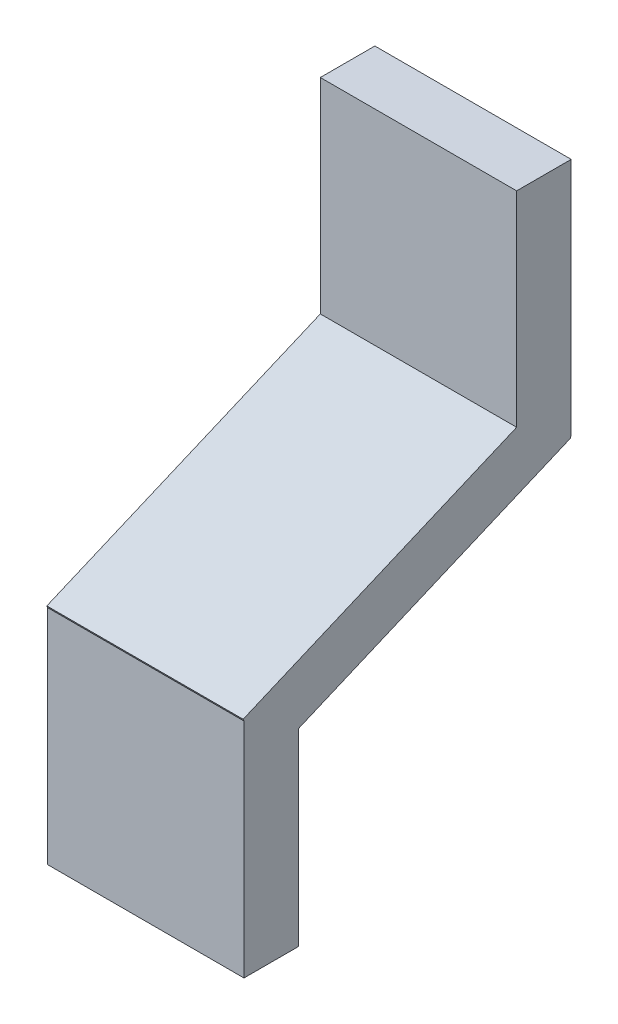
ISO-10303-21;
HEADER;
FILE_DESCRIPTION(('STEP AP214'),'2;1');
FILE_NAME('part.step','',(''),(''),'','','');
FILE_SCHEMA(('AUTOMOTIVE_DESIGN { 1 0 10303 214 1 1 1 1 }'));
ENDSEC;
DATA;
#1=APPLICATION_CONTEXT('core data for automotive mechanical design processes');
#2=APPLICATION_PROTOCOL_DEFINITION('international standard','automotive_design',2000,#1);
#3=PRODUCT_CONTEXT('',#1,'mechanical');
#4=PRODUCT('Part','Part','',(#3));
#5=PRODUCT_RELATED_PRODUCT_CATEGORY('part','',(#4));
#6=PRODUCT_DEFINITION_FORMATION('','',#4);
#7=PRODUCT_DEFINITION_CONTEXT('part definition',#1,'design');
#8=PRODUCT_DEFINITION('design','',#6,#7);
#9=PRODUCT_DEFINITION_SHAPE('','',#8);
#10=(LENGTH_UNIT() NAMED_UNIT(*) SI_UNIT(.MILLI.,.METRE.));
#11=(NAMED_UNIT(*) PLANE_ANGLE_UNIT() SI_UNIT($,.RADIAN.));
#12=(NAMED_UNIT(*) SI_UNIT($,.STERADIAN.) SOLID_ANGLE_UNIT());
#13=UNCERTAINTY_MEASURE_WITH_UNIT(LENGTH_MEASURE(1.E-05),#10,'distance_accuracy_value','');
#14=(GEOMETRIC_REPRESENTATION_CONTEXT(3) GLOBAL_UNCERTAINTY_ASSIGNED_CONTEXT((#13)) GLOBAL_UNIT_ASSIGNED_CONTEXT((#10,
#11,#12)) REPRESENTATION_CONTEXT('',''));
#15=CARTESIAN_POINT('',(0.,0.,0.));
#16=DIRECTION('',(0.,0.,1.));
#17=DIRECTION('',(1.,0.,0.));
#18=AXIS2_PLACEMENT_3D('',#15,#16,#17);
#19=CARTESIAN_POINT('',(1.82,11.,0.5));
#20=DIRECTION('',(0.,0.,1.));
#21=DIRECTION('',(1.,0.,0.));
#22=AXIS2_PLACEMENT_3D('',#19,#20,#21);
#23=PLANE('',#22);
#24=DIRECTION('',(1.,0.,0.));
#25=VECTOR('',#24,1.);
#26=CARTESIAN_POINT('',(1.82,11.3461054439247,0.500000000000314));
#27=LINE('',#26,#25);
#28=CARTESIAN_POINT('',(2.180000014305,11.3461054439242,0.500000000000105));
#29=VERTEX_POINT('',#28);
#30=CARTESIAN_POINT('',(1.82,11.3461054439243,0.500000000000105));
#31=VERTEX_POINT('',#30);
#32=EDGE_CURVE('E148',#29,#31,#27,.F.);
#33=ORIENTED_EDGE('',*,*,#32,.F.);
#34=DIRECTION('',(0.,1.,0.));
#35=VECTOR('',#34,1.);
#36=CARTESIAN_POINT('',(2.180000014305,11.65,0.5));
#37=LINE('',#36,#35);
#38=CARTESIAN_POINT('',(2.180000014305,11.,0.5));
#39=VERTEX_POINT('',#38);
#40=EDGE_CURVE('E154',#39,#29,#37,.T.);
#41=ORIENTED_EDGE('',*,*,#40,.F.);
#42=DIRECTION('',(1.,0.,0.));
#43=VECTOR('',#42,1.);
#44=CARTESIAN_POINT('',(1.82,11.,0.5));
#45=LINE('',#44,#43);
#46=CARTESIAN_POINT('',(1.82,11.,0.5));
#47=VERTEX_POINT('',#46);
#48=EDGE_CURVE('E135',#39,#47,#45,.F.);
#49=ORIENTED_EDGE('',*,*,#48,.T.);
#50=DIRECTION('',(0.,1.,0.));
#51=VECTOR('',#50,1.);
#52=CARTESIAN_POINT('',(1.82,11.65,0.5));
#53=LINE('',#52,#51);
#54=EDGE_CURVE('E182',#47,#31,#53,.T.);
#55=ORIENTED_EDGE('',*,*,#54,.T.);
#56=EDGE_LOOP('',(#33,#41,#49,#55));
#57=FACE_BOUND('',#56,.T.);
#58=ADVANCED_FACE('F17',(#57),#23,.F.);
#59=CARTESIAN_POINT('',(1.82,11.557949520001,0.0009268707435865));
#60=DIRECTION('',(0.,-0.920504786278108,-0.390731286742046));
#61=DIRECTION('',(0.,0.390731286742046,-0.920504786278108));
#62=AXIS2_PLACEMENT_3D('',#59,#60,#61);
#63=PLANE('',#62);
#64=DIRECTION('',(0.,0.39073128674346,-0.920504786277508));
#65=VECTOR('',#64,1.);
#66=CARTESIAN_POINT('',(2.180000014305,11.346105443924,0.5));
#67=LINE('',#66,#65);
#68=CARTESIAN_POINT('',(2.180000014305,11.557949520001,0.000926870743687937));
#69=VERTEX_POINT('',#68);
#70=EDGE_CURVE('E151',#29,#69,#67,.T.);
#71=ORIENTED_EDGE('',*,*,#70,.F.);
#72=ORIENTED_EDGE('',*,*,#32,.T.);
#73=DIRECTION('',(0.,0.39073128674346,-0.920504786277508));
#74=VECTOR('',#73,1.);
#75=CARTESIAN_POINT('',(1.82,11.346105443924,0.5));
#76=LINE('',#75,#74);
#77=CARTESIAN_POINT('',(1.82,11.557949520001,0.000926870743697301));
#78=VERTEX_POINT('',#77);
#79=EDGE_CURVE('E178',#31,#78,#76,.T.);
#80=ORIENTED_EDGE('',*,*,#79,.T.);
#81=DIRECTION('',(1.,0.,0.));
#82=VECTOR('',#81,1.);
#83=CARTESIAN_POINT('',(1.82,11.557949520001,0.00092687074374427));
#84=LINE('',#83,#82);
#85=EDGE_CURVE('E145',#78,#69,#84,.T.);
#86=ORIENTED_EDGE('',*,*,#85,.T.);
#87=EDGE_LOOP('',(#71,#72,#80,#86));
#88=FACE_BOUND('',#87,.T.);
#89=ADVANCED_FACE('F242',(#88),#63,.T.);
#90=CARTESIAN_POINT('',(1.82,11.65,0.04));
#91=DIRECTION('',(0.,-0.390731286742046,0.920504786278108));
#92=DIRECTION('',(0.,-0.920504786278108,-0.390731286742046));
#93=AXIS2_PLACEMENT_3D('',#90,#91,#92);
#94=PLANE('',#93);
#95=DIRECTION('',(0.,0.920504786259214,0.390731286786557));
#96=VECTOR('',#95,1.);
#97=CARTESIAN_POINT('',(1.82,11.557949520001,0.000926870743659899));
#98=LINE('',#97,#96);
#99=CARTESIAN_POINT('',(1.82,11.56,0.001797248280528));
#100=VERTEX_POINT('',#99);
#101=EDGE_CURVE('E123',#78,#100,#98,.T.);
#102=ORIENTED_EDGE('',*,*,#101,.T.);
#103=DIRECTION('',(1.,0.,0.));
#104=VECTOR('',#103,1.);
#105=CARTESIAN_POINT('',(1.82,11.56,0.001797248280528));
#106=LINE('',#105,#104);
#107=CARTESIAN_POINT('',(2.180000014305,11.56,0.001797248280528));
#108=VERTEX_POINT('',#107);
#109=EDGE_CURVE('E97',#100,#108,#106,.T.);
#110=ORIENTED_EDGE('',*,*,#109,.T.);
#111=DIRECTION('',(0.,0.920504786259214,0.390731286786557));
#112=VECTOR('',#111,1.);
#113=CARTESIAN_POINT('',(2.180000014305,11.557949520001,0.000926870743659899));
#114=LINE('',#113,#112);
#115=EDGE_CURVE('E153',#69,#108,#114,.T.);
#116=ORIENTED_EDGE('',*,*,#115,.F.);
#117=ORIENTED_EDGE('',*,*,#85,.F.);
#118=EDGE_LOOP('',(#102,#110,#116,#117));
#119=FACE_BOUND('',#118,.T.);
#120=ADVANCED_FACE('F243',(#119),#94,.F.);
#121=CARTESIAN_POINT('',(1.82,11.56,0.));
#122=DIRECTION('',(0.,1.,0.));
#123=DIRECTION('',(0.,0.,1.));
#124=AXIS2_PLACEMENT_3D('',#121,#122,#123);
#125=PLANE('',#124);
#126=ORIENTED_EDGE('',*,*,#109,.F.);
#127=DIRECTION('',(0.,0.,1.));
#128=VECTOR('',#127,1.);
#129=CARTESIAN_POINT('',(1.82,11.56,0.));
#130=LINE('',#129,#128);
#131=CARTESIAN_POINT('',(1.82,11.56,0.));
#132=VERTEX_POINT('',#131);
#133=EDGE_CURVE('E20',#100,#132,#130,.F.);
#134=ORIENTED_EDGE('',*,*,#133,.T.);
#135=DIRECTION('',(1.,0.,0.));
#136=VECTOR('',#135,1.);
#137=CARTESIAN_POINT('',(1.82,11.56,0.));
#138=LINE('',#137,#136);
#139=CARTESIAN_POINT('',(2.180000014305,11.56,0.));
#140=VERTEX_POINT('',#139);
#141=EDGE_CURVE('E104',#132,#140,#138,.T.);
#142=ORIENTED_EDGE('',*,*,#141,.T.);
#143=DIRECTION('',(0.,0.,-1.));
#144=VECTOR('',#143,1.);
#145=CARTESIAN_POINT('',(2.180000014305,11.56,0.04));
#146=LINE('',#145,#144);
#147=EDGE_CURVE('E194',#108,#140,#146,.T.);
#148=ORIENTED_EDGE('',*,*,#147,.F.);
#149=EDGE_LOOP('',(#126,#134,#142,#148));
#150=FACE_BOUND('',#149,.T.);
#151=ADVANCED_FACE('F122',(#150),#125,.F.);
#152=CARTESIAN_POINT('',(1.82,11.56,0.));
#153=DIRECTION('',(0.,0.,1.));
#154=DIRECTION('',(1.,0.,0.));
#155=AXIS2_PLACEMENT_3D('',#152,#153,#154);
#156=PLANE('',#155);
#157=ORIENTED_EDGE('',*,*,#141,.F.);
#158=DIRECTION('',(0.,1.,0.));
#159=VECTOR('',#158,1.);
#160=CARTESIAN_POINT('',(1.82,11.65,0.));
#161=LINE('',#160,#159);
#162=CARTESIAN_POINT('',(1.82,11.999999997616,0.));
#163=VERTEX_POINT('',#162);
#164=EDGE_CURVE('E108',#132,#163,#161,.T.);
#165=ORIENTED_EDGE('',*,*,#164,.T.);
#166=DIRECTION('',(1.,0.,0.));
#167=VECTOR('',#166,1.);
#168=CARTESIAN_POINT('',(1.82,11.999999997616,0.));
#169=LINE('',#168,#167);
#170=CARTESIAN_POINT('',(2.180000014305,11.999999997616,0.));
#171=VERTEX_POINT('',#170);
#172=EDGE_CURVE('E110',#171,#163,#169,.F.);
#173=ORIENTED_EDGE('',*,*,#172,.F.);
#174=DIRECTION('',(0.,1.,0.));
#175=VECTOR('',#174,1.);
#176=CARTESIAN_POINT('',(2.180000014305,11.65,0.));
#177=LINE('',#176,#175);
#178=EDGE_CURVE('E109',#140,#171,#177,.T.);
#179=ORIENTED_EDGE('',*,*,#178,.F.);
#180=EDGE_LOOP('',(#157,#165,#173,#179));
#181=FACE_BOUND('',#180,.T.);
#182=ADVANCED_FACE('F106',(#181),#156,.F.);
#183=CARTESIAN_POINT('',(1.82,11.999999997616,0.));
#184=DIRECTION('',(0.,1.,0.));
#185=DIRECTION('',(0.,0.,1.));
#186=AXIS2_PLACEMENT_3D('',#183,#184,#185);
#187=PLANE('',#186);
#188=ORIENTED_EDGE('',*,*,#172,.T.);
#189=DIRECTION('',(0.,0.,-1.));
#190=VECTOR('',#189,1.);
#191=CARTESIAN_POINT('',(1.82,11.999999997616,0.04));
#192=LINE('',#191,#190);
#193=CARTESIAN_POINT('',(1.82,11.999999997616,0.10000000149));
#194=VERTEX_POINT('',#193);
#195=EDGE_CURVE('E120',#163,#194,#192,.F.);
#196=ORIENTED_EDGE('',*,*,#195,.T.);
#197=DIRECTION('',(1.,0.,0.));
#198=VECTOR('',#197,1.);
#199=CARTESIAN_POINT('',(1.82,11.999999997616,0.10000000149));
#200=LINE('',#199,#198);
#201=CARTESIAN_POINT('',(2.180000014305,11.999999997616,0.10000000149));
#202=VERTEX_POINT('',#201);
#203=EDGE_CURVE('E181',#202,#194,#200,.F.);
#204=ORIENTED_EDGE('',*,*,#203,.F.);
#205=DIRECTION('',(0.,0.,-1.));
#206=VECTOR('',#205,1.);
#207=CARTESIAN_POINT('',(2.180000014305,11.999999997616,0.04));
#208=LINE('',#207,#206);
#209=EDGE_CURVE('E140',#171,#202,#208,.F.);
#210=ORIENTED_EDGE('',*,*,#209,.F.);
#211=EDGE_LOOP('',(#188,#196,#204,#210));
#212=FACE_BOUND('',#211,.T.);
#213=ADVANCED_FACE('F271',(#212),#187,.T.);
#214=CARTESIAN_POINT('',(1.82,11.,0.60000000149));
#215=DIRECTION('',(0.,0.,1.));
#216=DIRECTION('',(1.,0.,0.));
#217=AXIS2_PLACEMENT_3D('',#214,#215,#216);
#218=PLANE('',#217);
#219=DIRECTION('',(0.,1.,0.));
#220=VECTOR('',#219,1.);
#221=CARTESIAN_POINT('',(2.180000014305,11.65,0.60000000149));
#222=LINE('',#221,#220);
#223=CARTESIAN_POINT('',(2.180000014305,11.408101447657,0.600000001490072));
#224=VERTEX_POINT('',#223);
#225=CARTESIAN_POINT('',(2.180000014305,11.,0.60000000149));
#226=VERTEX_POINT('',#225);
#227=EDGE_CURVE('E168',#224,#226,#222,.F.);
#228=ORIENTED_EDGE('',*,*,#227,.F.);
#229=DIRECTION('',(1.,0.,0.));
#230=VECTOR('',#229,1.);
#231=CARTESIAN_POINT('',(1.82,11.4081014476569,0.600000001490144));
#232=LINE('',#231,#230);
#233=CARTESIAN_POINT('',(1.82,11.408101447657,0.600000001490072));
#234=VERTEX_POINT('',#233);
#235=EDGE_CURVE('E124',#234,#224,#232,.T.);
#236=ORIENTED_EDGE('',*,*,#235,.F.);
#237=DIRECTION('',(0.,1.,0.));
#238=VECTOR('',#237,1.);
#239=CARTESIAN_POINT('',(1.82,11.65,0.60000000149));
#240=LINE('',#239,#238);
#241=CARTESIAN_POINT('',(1.82,11.,0.60000000149));
#242=VERTEX_POINT('',#241);
#243=EDGE_CURVE('E192',#234,#242,#240,.F.);
#244=ORIENTED_EDGE('',*,*,#243,.T.);
#245=DIRECTION('',(1.,0.,0.));
#246=VECTOR('',#245,1.);
#247=CARTESIAN_POINT('',(1.82,11.,0.60000000149));
#248=LINE('',#247,#246);
#249=EDGE_CURVE('E127',#242,#226,#248,.T.);
#250=ORIENTED_EDGE('',*,*,#249,.T.);
#251=EDGE_LOOP('',(#228,#236,#244,#250));
#252=FACE_BOUND('',#251,.T.);
#253=ADVANCED_FACE('F232',(#252),#218,.T.);
#254=CARTESIAN_POINT('',(1.82,11.,0.5));
#255=DIRECTION('',(0.,1.,0.));
#256=DIRECTION('',(0.,0.,1.));
#257=AXIS2_PLACEMENT_3D('',#254,#255,#256);
#258=PLANE('',#257);
#259=DIRECTION('',(0.,0.,-1.));
#260=VECTOR('',#259,1.);
#261=CARTESIAN_POINT('',(1.82,11.,0.04));
#262=LINE('',#261,#260);
#263=EDGE_CURVE('E187',#242,#47,#262,.T.);
#264=ORIENTED_EDGE('',*,*,#263,.T.);
#265=ORIENTED_EDGE('',*,*,#48,.F.);
#266=DIRECTION('',(0.,0.,-1.));
#267=VECTOR('',#266,1.);
#268=CARTESIAN_POINT('',(2.180000014305,11.,0.04));
#269=LINE('',#268,#267);
#270=EDGE_CURVE('E164',#226,#39,#269,.T.);
#271=ORIENTED_EDGE('',*,*,#270,.F.);
#272=ORIENTED_EDGE('',*,*,#249,.F.);
#273=EDGE_LOOP('',(#264,#265,#271,#272));
#274=FACE_BOUND('',#273,.T.);
#275=ADVANCED_FACE('F235',(#274),#258,.F.);
#276=CARTESIAN_POINT('',(1.82,11.411653909498,0.601507932798));
#277=DIRECTION('',(0.,-0.390731286742046,0.920504786278108));
#278=DIRECTION('',(0.,-0.920504786278108,-0.390731286742046));
#279=AXIS2_PLACEMENT_3D('',#276,#277,#278);
#280=PLANE('',#279);
#281=ORIENTED_EDGE('',*,*,#235,.T.);
#282=DIRECTION('',(0.,-0.920504786262243,-0.390731286779422));
#283=VECTOR('',#282,1.);
#284=CARTESIAN_POINT('',(2.180000014305,11.411653909498,0.601507932798));
#285=LINE('',#284,#283);
#286=CARTESIAN_POINT('',(2.180000014305,11.4116539094979,0.601507932797974));
#287=VERTEX_POINT('',#286);
#288=EDGE_CURVE('E227',#287,#224,#285,.T.);
#289=ORIENTED_EDGE('',*,*,#288,.F.);
#290=DIRECTION('',(1.,0.,0.));
#291=VECTOR('',#290,1.);
#292=CARTESIAN_POINT('',(1.82,11.4116539094978,0.601507932797897));
#293=LINE('',#292,#291);
#294=CARTESIAN_POINT('',(1.82,11.4116539094979,0.601507932797974));
#295=VERTEX_POINT('',#294);
#296=EDGE_CURVE('E167',#287,#295,#293,.F.);
#297=ORIENTED_EDGE('',*,*,#296,.T.);
#298=DIRECTION('',(0.,-0.920504786262243,-0.390731286779422));
#299=VECTOR('',#298,1.);
#300=CARTESIAN_POINT('',(1.82,11.411653909498,0.601507932798));
#301=LINE('',#300,#299);
#302=EDGE_CURVE('E175',#295,#234,#301,.T.);
#303=ORIENTED_EDGE('',*,*,#302,.T.);
#304=EDGE_LOOP('',(#281,#289,#297,#303));
#305=FACE_BOUND('',#304,.T.);
#306=ADVANCED_FACE('F210',(#305),#280,.T.);
#307=CARTESIAN_POINT('',(1.82,11.65,0.04));
#308=DIRECTION('',(1.,0.,0.));
#309=DIRECTION('',(0.,0.,-1.));
#310=AXIS2_PLACEMENT_3D('',#307,#308,#309);
#311=PLANE('',#310);
#312=ORIENTED_EDGE('',*,*,#54,.F.);
#313=ORIENTED_EDGE('',*,*,#263,.F.);
#314=ORIENTED_EDGE('',*,*,#243,.F.);
#315=ORIENTED_EDGE('',*,*,#302,.F.);
#316=DIRECTION('',(0.,0.390731286742046,-0.920504786278108));
#317=VECTOR('',#316,1.);
#318=CARTESIAN_POINT('',(1.82,11.65,0.04));
#319=LINE('',#318,#317);
#320=CARTESIAN_POINT('',(1.82,11.624531498221,0.100000001490019));
#321=VERTEX_POINT('',#320);
#322=EDGE_CURVE('E216',#295,#321,#319,.T.);
#323=ORIENTED_EDGE('',*,*,#322,.T.);
#324=DIRECTION('',(0.,1.,0.));
#325=VECTOR('',#324,1.);
#326=CARTESIAN_POINT('',(1.82,11.56,0.10000000149));
#327=LINE('',#326,#325);
#328=EDGE_CURVE('E161',#194,#321,#327,.F.);
#329=ORIENTED_EDGE('',*,*,#328,.F.);
#330=ORIENTED_EDGE('',*,*,#195,.F.);
#331=ORIENTED_EDGE('',*,*,#164,.F.);
#332=ORIENTED_EDGE('',*,*,#133,.F.);
#333=ORIENTED_EDGE('',*,*,#101,.F.);
#334=ORIENTED_EDGE('',*,*,#79,.F.);
#335=EDGE_LOOP('',(#312,#313,#314,#315,#323,#329,#330,#331,#332,#333,#334));
#336=FACE_BOUND('',#335,.T.);
#337=ADVANCED_FACE('F115',(#336),#311,.F.);
#338=CARTESIAN_POINT('',(1.82,11.56,0.10000000149));
#339=DIRECTION('',(0.,0.,1.));
#340=DIRECTION('',(1.,0.,0.));
#341=AXIS2_PLACEMENT_3D('',#338,#339,#340);
#342=PLANE('',#341);
#343=ORIENTED_EDGE('',*,*,#328,.T.);
#344=DIRECTION('',(1.,0.,0.));
#345=VECTOR('',#344,1.);
#346=CARTESIAN_POINT('',(1.82,11.6245314982212,0.100000001490075));
#347=LINE('',#346,#345);
#348=CARTESIAN_POINT('',(2.180000014305,11.624531498221,0.100000001490019));
#349=VERTEX_POINT('',#348);
#350=EDGE_CURVE('E26',#321,#349,#347,.T.);
#351=ORIENTED_EDGE('',*,*,#350,.T.);
#352=DIRECTION('',(0.,1.,0.));
#353=VECTOR('',#352,1.);
#354=CARTESIAN_POINT('',(2.180000014305,11.65,0.10000000149));
#355=LINE('',#354,#353);
#356=EDGE_CURVE('E34',#202,#349,#355,.F.);
#357=ORIENTED_EDGE('',*,*,#356,.F.);
#358=ORIENTED_EDGE('',*,*,#203,.T.);
#359=EDGE_LOOP('',(#343,#351,#357,#358));
#360=FACE_BOUND('',#359,.T.);
#361=ADVANCED_FACE('F257',(#360),#342,.T.);
#362=CARTESIAN_POINT('',(2.180000014305,11.65,0.04));
#363=DIRECTION('',(1.,0.,0.));
#364=DIRECTION('',(0.,0.,-1.));
#365=AXIS2_PLACEMENT_3D('',#362,#363,#364);
#366=PLANE('',#365);
#367=ORIENTED_EDGE('',*,*,#227,.T.);
#368=ORIENTED_EDGE('',*,*,#270,.T.);
#369=ORIENTED_EDGE('',*,*,#40,.T.);
#370=ORIENTED_EDGE('',*,*,#70,.T.);
#371=ORIENTED_EDGE('',*,*,#115,.T.);
#372=ORIENTED_EDGE('',*,*,#147,.T.);
#373=ORIENTED_EDGE('',*,*,#178,.T.);
#374=ORIENTED_EDGE('',*,*,#209,.T.);
#375=ORIENTED_EDGE('',*,*,#356,.T.);
#376=DIRECTION('',(0.,0.390731286742046,-0.920504786278108));
#377=VECTOR('',#376,1.);
#378=CARTESIAN_POINT('',(2.180000014305,11.65,0.04));
#379=LINE('',#378,#377);
#380=EDGE_CURVE('E11',#349,#287,#379,.F.);
#381=ORIENTED_EDGE('',*,*,#380,.T.);
#382=ORIENTED_EDGE('',*,*,#288,.T.);
#383=EDGE_LOOP('',(#367,#368,#369,#370,#371,#372,#373,#374,#375,#381,#382));
#384=FACE_BOUND('',#383,.T.);
#385=ADVANCED_FACE('F230',(#384),#366,.T.);
#386=CARTESIAN_POINT('',(1.82,11.65,0.04));
#387=DIRECTION('',(0.,-0.920504786278108,-0.390731286742046));
#388=DIRECTION('',(0.,0.390731286742046,-0.920504786278108));
#389=AXIS2_PLACEMENT_3D('',#386,#387,#388);
#390=PLANE('',#389);
#391=ORIENTED_EDGE('',*,*,#350,.F.);
#392=ORIENTED_EDGE('',*,*,#322,.F.);
#393=ORIENTED_EDGE('',*,*,#296,.F.);
#394=ORIENTED_EDGE('',*,*,#380,.F.);
#395=EDGE_LOOP('',(#391,#392,#393,#394));
#396=FACE_BOUND('',#395,.T.);
#397=ADVANCED_FACE('F220',(#396),#390,.F.);
#398=CLOSED_SHELL('',(#58,#89,#120,#151,#182,#213,#253,#275,#306,#337,#361,#385,#397));
#399=MANIFOLD_SOLID_BREP('B1',#398);
#400=ADVANCED_BREP_SHAPE_REPRESENTATION('',(#18,#399),#14);
#401=SHAPE_DEFINITION_REPRESENTATION(#9,#400);
ENDSEC;
END-ISO-10303-21;
